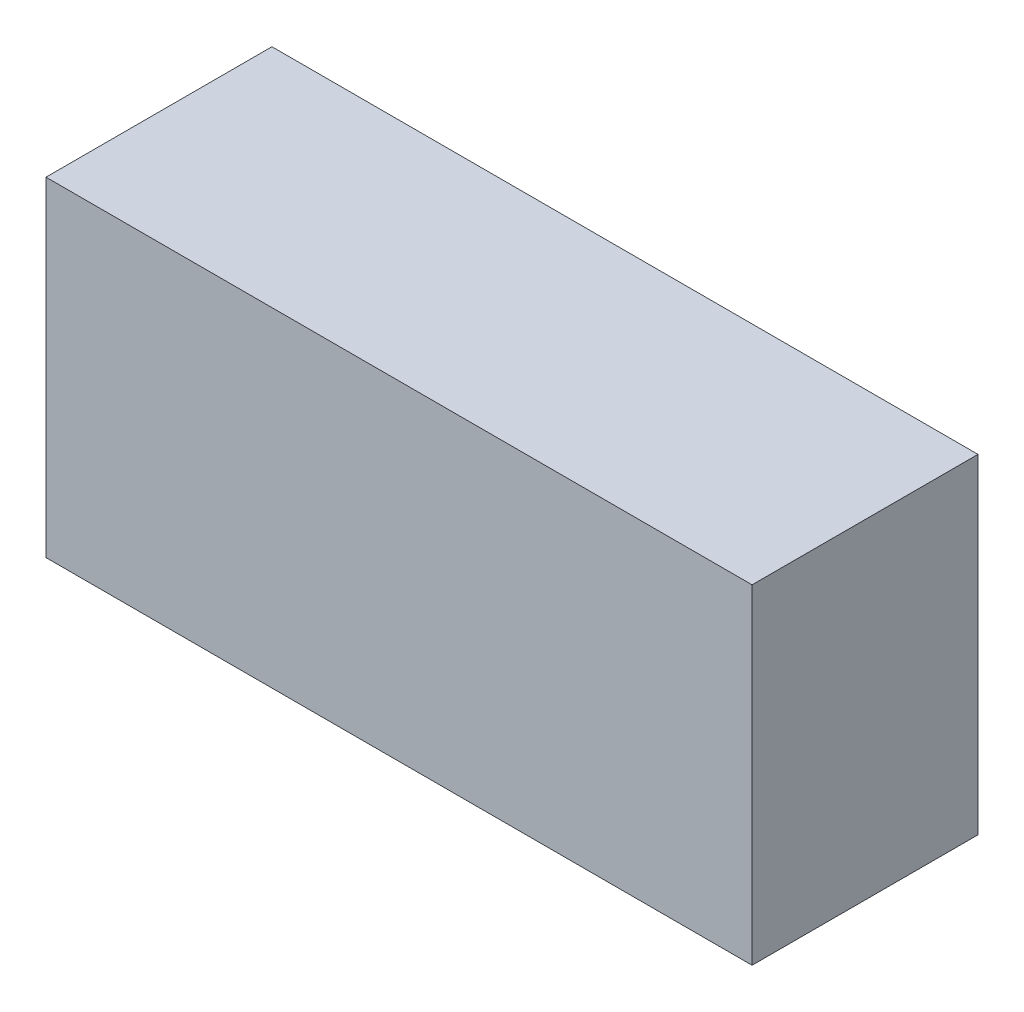
ISO-10303-21;
HEADER;
FILE_DESCRIPTION(('STEP AP214'),'2;1');
FILE_NAME('part.step','',(''),(''),'','','');
FILE_SCHEMA(('AUTOMOTIVE_DESIGN { 1 0 10303 214 1 1 1 1 }'));
ENDSEC;
DATA;
#1=APPLICATION_CONTEXT('core data for automotive mechanical design processes');
#2=APPLICATION_PROTOCOL_DEFINITION('international standard','automotive_design',2000,#1);
#3=PRODUCT_CONTEXT('',#1,'mechanical');
#4=PRODUCT('Part','Part','',(#3));
#5=PRODUCT_RELATED_PRODUCT_CATEGORY('part','',(#4));
#6=PRODUCT_DEFINITION_FORMATION('','',#4);
#7=PRODUCT_DEFINITION_CONTEXT('part definition',#1,'design');
#8=PRODUCT_DEFINITION('design','',#6,#7);
#9=PRODUCT_DEFINITION_SHAPE('','',#8);
#10=(LENGTH_UNIT() NAMED_UNIT(*) SI_UNIT(.MILLI.,.METRE.));
#11=(NAMED_UNIT(*) PLANE_ANGLE_UNIT() SI_UNIT($,.RADIAN.));
#12=(NAMED_UNIT(*) SI_UNIT($,.STERADIAN.) SOLID_ANGLE_UNIT());
#13=UNCERTAINTY_MEASURE_WITH_UNIT(LENGTH_MEASURE(1.E-05),#10,'distance_accuracy_value','');
#14=(GEOMETRIC_REPRESENTATION_CONTEXT(3) GLOBAL_UNCERTAINTY_ASSIGNED_CONTEXT((#13)) GLOBAL_UNIT_ASSIGNED_CONTEXT((#10,
#11,#12)) REPRESENTATION_CONTEXT('',''));
#15=CARTESIAN_POINT('',(0.,0.,0.));
#16=DIRECTION('',(0.,0.,1.));
#17=DIRECTION('',(1.,0.,0.));
#18=AXIS2_PLACEMENT_3D('',#15,#16,#17);
#19=CARTESIAN_POINT('',(0.,0.,24.));
#20=DIRECTION('',(1.,0.,0.));
#21=DIRECTION('',(0.,0.,-1.));
#22=AXIS2_PLACEMENT_3D('',#19,#20,#21);
#23=PLANE('',#22);
#24=DIRECTION('',(0.,-1.,0.));
#25=VECTOR('',#24,1.);
#26=CARTESIAN_POINT('',(0.,0.,0.));
#27=LINE('',#26,#25);
#28=CARTESIAN_POINT('',(0.,35.,0.));
#29=VERTEX_POINT('',#28);
#30=CARTESIAN_POINT('',(0.,0.,0.));
#31=VERTEX_POINT('',#30);
#32=EDGE_CURVE('E96',#29,#31,#27,.T.);
#33=ORIENTED_EDGE('',*,*,#32,.T.);
#34=DIRECTION('',(0.,0.,-1.));
#35=VECTOR('',#34,1.);
#36=CARTESIAN_POINT('',(0.,0.,24.));
#37=LINE('',#36,#35);
#38=CARTESIAN_POINT('',(0.,0.,24.));
#39=VERTEX_POINT('',#38);
#40=EDGE_CURVE('E11',#39,#31,#37,.T.);
#41=ORIENTED_EDGE('',*,*,#40,.F.);
#42=DIRECTION('',(0.,-1.,0.));
#43=VECTOR('',#42,1.);
#44=CARTESIAN_POINT('',(0.,0.,24.));
#45=LINE('',#44,#43);
#46=CARTESIAN_POINT('',(0.,35.,24.));
#47=VERTEX_POINT('',#46);
#48=EDGE_CURVE('E84',#47,#39,#45,.T.);
#49=ORIENTED_EDGE('',*,*,#48,.F.);
#50=DIRECTION('',(0.,0.,-1.));
#51=VECTOR('',#50,1.);
#52=CARTESIAN_POINT('',(0.,35.,24.));
#53=LINE('',#52,#51);
#54=EDGE_CURVE('E92',#47,#29,#53,.T.);
#55=ORIENTED_EDGE('',*,*,#54,.T.);
#56=EDGE_LOOP('',(#33,#41,#49,#55));
#57=FACE_BOUND('',#56,.T.);
#58=ADVANCED_FACE('F33',(#57),#23,.F.);
#59=CARTESIAN_POINT('',(0.,0.,24.));
#60=DIRECTION('',(0.,1.,0.));
#61=DIRECTION('',(0.,0.,1.));
#62=AXIS2_PLACEMENT_3D('',#59,#60,#61);
#63=PLANE('',#62);
#64=DIRECTION('',(1.,0.,0.));
#65=VECTOR('',#64,1.);
#66=CARTESIAN_POINT('',(0.,0.,0.));
#67=LINE('',#66,#65);
#68=CARTESIAN_POINT('',(75.,0.,0.));
#69=VERTEX_POINT('',#68);
#70=EDGE_CURVE('E88',#31,#69,#67,.T.);
#71=ORIENTED_EDGE('',*,*,#70,.T.);
#72=DIRECTION('',(0.,0.,-1.));
#73=VECTOR('',#72,1.);
#74=CARTESIAN_POINT('',(75.,0.,24.));
#75=LINE('',#74,#73);
#76=CARTESIAN_POINT('',(75.,0.,24.));
#77=VERTEX_POINT('',#76);
#78=EDGE_CURVE('E41',#77,#69,#75,.T.);
#79=ORIENTED_EDGE('',*,*,#78,.F.);
#80=DIRECTION('',(1.,0.,0.));
#81=VECTOR('',#80,1.);
#82=CARTESIAN_POINT('',(0.,0.,24.));
#83=LINE('',#82,#81);
#84=EDGE_CURVE('E79',#39,#77,#83,.T.);
#85=ORIENTED_EDGE('',*,*,#84,.F.);
#86=ORIENTED_EDGE('',*,*,#40,.T.);
#87=EDGE_LOOP('',(#71,#79,#85,#86));
#88=FACE_BOUND('',#87,.T.);
#89=ADVANCED_FACE('F87',(#88),#63,.F.);
#90=CARTESIAN_POINT('',(75.,0.,24.));
#91=DIRECTION('',(-1.,0.,0.));
#92=DIRECTION('',(0.,0.,1.));
#93=AXIS2_PLACEMENT_3D('',#90,#91,#92);
#94=PLANE('',#93);
#95=DIRECTION('',(0.,1.,0.));
#96=VECTOR('',#95,1.);
#97=CARTESIAN_POINT('',(75.,0.,0.));
#98=LINE('',#97,#96);
#99=CARTESIAN_POINT('',(75.,35.,0.));
#100=VERTEX_POINT('',#99);
#101=EDGE_CURVE('E66',#69,#100,#98,.T.);
#102=ORIENTED_EDGE('',*,*,#101,.T.);
#103=DIRECTION('',(0.,0.,-1.));
#104=VECTOR('',#103,1.);
#105=CARTESIAN_POINT('',(75.,35.,24.));
#106=LINE('',#105,#104);
#107=CARTESIAN_POINT('',(75.,35.,24.));
#108=VERTEX_POINT('',#107);
#109=EDGE_CURVE('E89',#108,#100,#106,.T.);
#110=ORIENTED_EDGE('',*,*,#109,.F.);
#111=DIRECTION('',(0.,1.,0.));
#112=VECTOR('',#111,1.);
#113=CARTESIAN_POINT('',(75.,0.,24.));
#114=LINE('',#113,#112);
#115=EDGE_CURVE('E82',#77,#108,#114,.T.);
#116=ORIENTED_EDGE('',*,*,#115,.F.);
#117=ORIENTED_EDGE('',*,*,#78,.T.);
#118=EDGE_LOOP('',(#102,#110,#116,#117));
#119=FACE_BOUND('',#118,.T.);
#120=ADVANCED_FACE('F90',(#119),#94,.F.);
#121=CARTESIAN_POINT('',(0.,35.,24.));
#122=DIRECTION('',(0.,-1.,0.));
#123=DIRECTION('',(0.,0.,-1.));
#124=AXIS2_PLACEMENT_3D('',#121,#122,#123);
#125=PLANE('',#124);
#126=DIRECTION('',(-1.,0.,0.));
#127=VECTOR('',#126,1.);
#128=CARTESIAN_POINT('',(0.,35.,0.));
#129=LINE('',#128,#127);
#130=EDGE_CURVE('E72',#100,#29,#129,.T.);
#131=ORIENTED_EDGE('',*,*,#130,.T.);
#132=ORIENTED_EDGE('',*,*,#54,.F.);
#133=DIRECTION('',(-1.,0.,0.));
#134=VECTOR('',#133,1.);
#135=CARTESIAN_POINT('',(0.,35.,24.));
#136=LINE('',#135,#134);
#137=EDGE_CURVE('E49',#108,#47,#136,.T.);
#138=ORIENTED_EDGE('',*,*,#137,.F.);
#139=ORIENTED_EDGE('',*,*,#109,.T.);
#140=EDGE_LOOP('',(#131,#132,#138,#139));
#141=FACE_BOUND('',#140,.T.);
#142=ADVANCED_FACE('F103',(#141),#125,.F.);
#143=CARTESIAN_POINT('',(0.,0.,24.));
#144=DIRECTION('',(0.,0.,-1.));
#145=DIRECTION('',(-1.,0.,0.));
#146=AXIS2_PLACEMENT_3D('',#143,#144,#145);
#147=PLANE('',#146);
#148=ORIENTED_EDGE('',*,*,#48,.T.);
#149=ORIENTED_EDGE('',*,*,#84,.T.);
#150=ORIENTED_EDGE('',*,*,#115,.T.);
#151=ORIENTED_EDGE('',*,*,#137,.T.);
#152=EDGE_LOOP('',(#148,#149,#150,#151));
#153=FACE_BOUND('',#152,.T.);
#154=ADVANCED_FACE('F80',(#153),#147,.F.);
#155=CARTESIAN_POINT('',(0.,0.,0.));
#156=DIRECTION('',(0.,0.,-1.));
#157=DIRECTION('',(-1.,0.,0.));
#158=AXIS2_PLACEMENT_3D('',#155,#156,#157);
#159=PLANE('',#158);
#160=ORIENTED_EDGE('',*,*,#32,.F.);
#161=ORIENTED_EDGE('',*,*,#130,.F.);
#162=ORIENTED_EDGE('',*,*,#101,.F.);
#163=ORIENTED_EDGE('',*,*,#70,.F.);
#164=EDGE_LOOP('',(#160,#161,#162,#163));
#165=FACE_BOUND('',#164,.T.);
#166=ADVANCED_FACE('F106',(#165),#159,.T.);
#167=CLOSED_SHELL('',(#58,#89,#120,#142,#154,#166));
#168=MANIFOLD_SOLID_BREP('B2',#167);
#169=ADVANCED_BREP_SHAPE_REPRESENTATION('',(#18,#168),#14);
#170=SHAPE_DEFINITION_REPRESENTATION(#9,#169);
ENDSEC;
END-ISO-10303-21;
